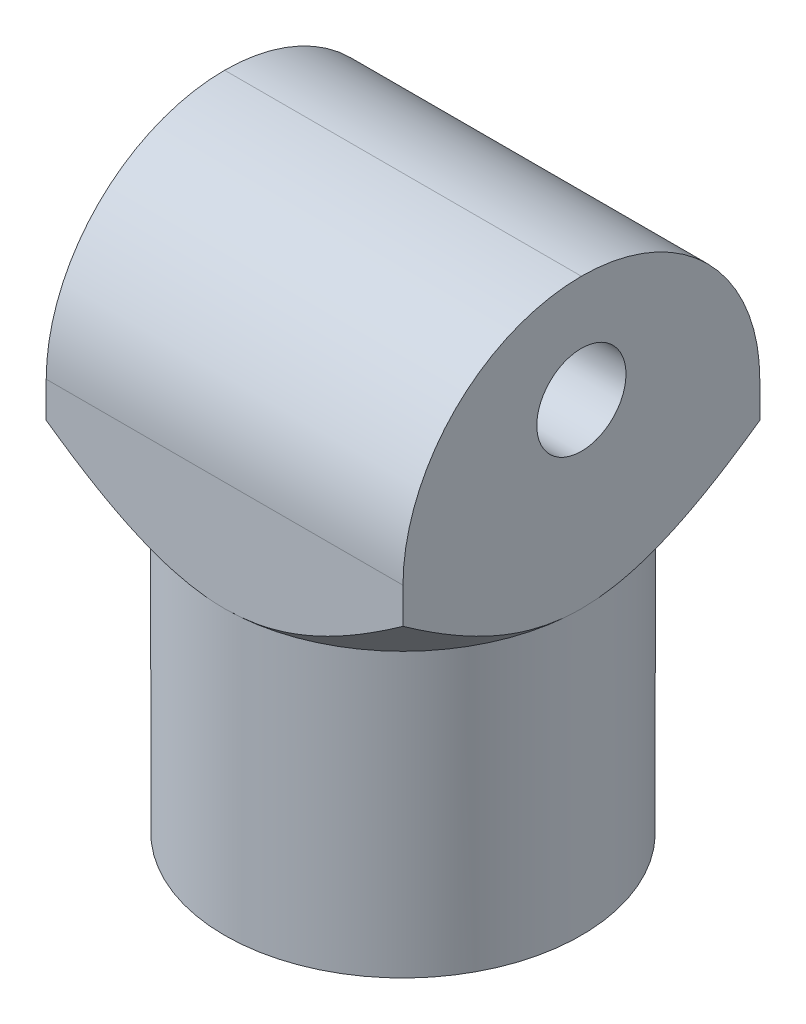
ISO-10303-21;
HEADER;
FILE_DESCRIPTION(('STEP AP214'),'2;1');
FILE_NAME('part.step','',(''),(''),'','','');
FILE_SCHEMA(('AUTOMOTIVE_DESIGN { 1 0 10303 214 1 1 1 1 }'));
ENDSEC;
DATA;
#1=APPLICATION_CONTEXT('core data for automotive mechanical design processes');
#2=APPLICATION_PROTOCOL_DEFINITION('international standard','automotive_design',2000,#1);
#3=PRODUCT_CONTEXT('',#1,'mechanical');
#4=PRODUCT('Part','Part','',(#3));
#5=PRODUCT_RELATED_PRODUCT_CATEGORY('part','',(#4));
#6=PRODUCT_DEFINITION_FORMATION('','',#4);
#7=PRODUCT_DEFINITION_CONTEXT('part definition',#1,'design');
#8=PRODUCT_DEFINITION('design','',#6,#7);
#9=PRODUCT_DEFINITION_SHAPE('','',#8);
#10=(LENGTH_UNIT() NAMED_UNIT(*) SI_UNIT(.MILLI.,.METRE.));
#11=(NAMED_UNIT(*) PLANE_ANGLE_UNIT() SI_UNIT($,.RADIAN.));
#12=(NAMED_UNIT(*) SI_UNIT($,.STERADIAN.) SOLID_ANGLE_UNIT());
#13=UNCERTAINTY_MEASURE_WITH_UNIT(LENGTH_MEASURE(1.E-05),#10,'distance_accuracy_value','');
#14=(GEOMETRIC_REPRESENTATION_CONTEXT(3) GLOBAL_UNCERTAINTY_ASSIGNED_CONTEXT((#13)) GLOBAL_UNIT_ASSIGNED_CONTEXT((#10,
#11,#12)) REPRESENTATION_CONTEXT('',''));
#15=CARTESIAN_POINT('',(0.,0.,0.));
#16=DIRECTION('',(0.,0.,1.));
#17=DIRECTION('',(1.,0.,0.));
#18=AXIS2_PLACEMENT_3D('',#15,#16,#17);
#19=CARTESIAN_POINT('',(0.,0.,0.));
#20=DIRECTION('',(0.,-1.,0.));
#21=DIRECTION('',(0.,0.,-1.));
#22=AXIS2_PLACEMENT_3D('',#19,#20,#21);
#23=PLANE('',#22);
#24=DIRECTION('',(0.,0.,-1.));
#25=VECTOR('',#24,1.);
#26=CARTESIAN_POINT('',(10.,0.,0.));
#27=LINE('',#26,#25);
#28=CARTESIAN_POINT('',(10.,0.,-9.9984897719211));
#29=VERTEX_POINT('',#28);
#30=CARTESIAN_POINT('',(10.,0.,-10.));
#31=VERTEX_POINT('',#30);
#32=EDGE_CURVE('E230',#29,#31,#27,.T.);
#33=ORIENTED_EDGE('',*,*,#32,.F.);
#34=CARTESIAN_POINT('',(5.,0.,-5.));
#35=DIRECTION('',(0.,-1.,0.));
#36=DIRECTION('',(0.,0.,-1.));
#37=AXIS2_PLACEMENT_3D('',#34,#35,#36);
#38=CIRCLE('',#37,7.06999999999999);
#39=CARTESIAN_POINT('',(9.9984897719211,0.,-10.));
#40=VERTEX_POINT('',#39);
#41=EDGE_CURVE('E279',#29,#40,#38,.F.);
#42=ORIENTED_EDGE('',*,*,#41,.T.);
#43=DIRECTION('',(-1.,0.,0.));
#44=VECTOR('',#43,1.);
#45=CARTESIAN_POINT('',(0.,0.,-10.));
#46=LINE('',#45,#44);
#47=EDGE_CURVE('E235',#31,#40,#46,.T.);
#48=ORIENTED_EDGE('',*,*,#47,.F.);
#49=EDGE_LOOP('',(#33,#42,#48));
#50=FACE_BOUND('',#49,.T.);
#51=ADVANCED_FACE('F32',(#50),#23,.T.);
#52=DIRECTION('',(1.,0.,0.));
#53=VECTOR('',#52,1.);
#54=CARTESIAN_POINT('',(0.,0.,0.));
#55=LINE('',#54,#53);
#56=CARTESIAN_POINT('',(9.9984897719211,0.,0.));
#57=VERTEX_POINT('',#56);
#58=CARTESIAN_POINT('',(10.,0.,0.));
#59=VERTEX_POINT('',#58);
#60=EDGE_CURVE('E226',#57,#59,#55,.T.);
#61=ORIENTED_EDGE('',*,*,#60,.F.);
#62=CARTESIAN_POINT('',(5.,0.,-5.));
#63=DIRECTION('',(0.,-1.,0.));
#64=DIRECTION('',(0.,0.,-1.));
#65=AXIS2_PLACEMENT_3D('',#62,#63,#64);
#66=CIRCLE('',#65,7.06999999999999);
#67=CARTESIAN_POINT('',(10.,0.,-0.00151022807889948));
#68=VERTEX_POINT('',#67);
#69=EDGE_CURVE('E274',#57,#68,#66,.F.);
#70=ORIENTED_EDGE('',*,*,#69,.T.);
#71=EDGE_CURVE('E231',#59,#68,#27,.T.);
#72=ORIENTED_EDGE('',*,*,#71,.F.);
#73=EDGE_LOOP('',(#61,#70,#72));
#74=FACE_BOUND('',#73,.T.);
#75=ADVANCED_FACE('F379',(#74),#23,.T.);
#76=DIRECTION('',(0.,0.,1.));
#77=VECTOR('',#76,1.);
#78=CARTESIAN_POINT('',(0.,0.,0.));
#79=LINE('',#78,#77);
#80=CARTESIAN_POINT('',(0.,0.,-0.00151022807889842));
#81=VERTEX_POINT('',#80);
#82=CARTESIAN_POINT('',(0.,0.,0.));
#83=VERTEX_POINT('',#82);
#84=EDGE_CURVE('E220',#81,#83,#79,.T.);
#85=ORIENTED_EDGE('',*,*,#84,.F.);
#86=CARTESIAN_POINT('',(5.,0.,-5.));
#87=DIRECTION('',(0.,-1.,0.));
#88=DIRECTION('',(0.,0.,-1.));
#89=AXIS2_PLACEMENT_3D('',#86,#87,#88);
#90=CIRCLE('',#89,7.06999999999999);
#91=CARTESIAN_POINT('',(0.00151022807889958,0.,0.));
#92=VERTEX_POINT('',#91);
#93=EDGE_CURVE('E277',#81,#92,#90,.F.);
#94=ORIENTED_EDGE('',*,*,#93,.T.);
#95=EDGE_CURVE('E227',#83,#92,#55,.T.);
#96=ORIENTED_EDGE('',*,*,#95,.F.);
#97=EDGE_LOOP('',(#85,#94,#96));
#98=FACE_BOUND('',#97,.T.);
#99=ADVANCED_FACE('F381',(#98),#23,.T.);
#100=CARTESIAN_POINT('',(0.,6.,0.));
#101=DIRECTION('',(1.,0.,0.));
#102=DIRECTION('',(0.,0.,-1.));
#103=AXIS2_PLACEMENT_3D('',#100,#101,#102);
#104=PLANE('',#103);
#105=CARTESIAN_POINT('',(0.,3.,-5.));
#106=DIRECTION('',(1.,0.,0.));
#107=DIRECTION('',(0.,0.,-1.));
#108=AXIS2_PLACEMENT_3D('',#105,#106,#107);
#109=CIRCLE('',#108,1.25);
#110=CARTESIAN_POINT('',(0.,3.,-6.25));
#111=VERTEX_POINT('',#110);
#112=EDGE_CURVE('E217',#111,#111,#109,.T.);
#113=ORIENTED_EDGE('',*,*,#112,.T.);
#114=EDGE_LOOP('',(#113));
#115=FACE_BOUND('',#114,.T.);
#116=CARTESIAN_POINT('',(0.,1.,-5.));
#117=DIRECTION('',(1.,0.,0.));
#118=DIRECTION('',(0.,0.,-1.));
#119=AXIS2_PLACEMENT_3D('',#116,#117,#118);
#120=CIRCLE('',#119,5.);
#121=CARTESIAN_POINT('',(0.,1.,0.));
#122=VERTEX_POINT('',#121);
#123=CARTESIAN_POINT('',(0.,6.,-5.));
#124=VERTEX_POINT('',#123);
#125=EDGE_CURVE('E249',#122,#124,#120,.F.);
#126=ORIENTED_EDGE('',*,*,#125,.T.);
#127=CARTESIAN_POINT('',(0.,1.,-5.));
#128=DIRECTION('',(1.,0.,0.));
#129=DIRECTION('',(0.,0.,-1.));
#130=AXIS2_PLACEMENT_3D('',#127,#128,#129);
#131=CIRCLE('',#130,5.);
#132=CARTESIAN_POINT('',(0.,1.,-10.));
#133=VERTEX_POINT('',#132);
#134=EDGE_CURVE('E251',#124,#133,#131,.F.);
#135=ORIENTED_EDGE('',*,*,#134,.T.);
#136=DIRECTION('',(0.,-1.,0.));
#137=VECTOR('',#136,1.);
#138=CARTESIAN_POINT('',(0.,6.,-10.));
#139=LINE('',#138,#137);
#140=CARTESIAN_POINT('',(0.,0.,-10.));
#141=VERTEX_POINT('',#140);
#142=EDGE_CURVE('E237',#133,#141,#139,.T.);
#143=ORIENTED_EDGE('',*,*,#142,.T.);
#144=CARTESIAN_POINT('',(0.,0.,-9.9984897719211));
#145=VERTEX_POINT('',#144);
#146=EDGE_CURVE('E224',#141,#145,#79,.T.);
#147=ORIENTED_EDGE('',*,*,#146,.T.);
#148=CARTESIAN_POINT('',(0.,0.,-9.9984897719211));
#149=CARTESIAN_POINT('',(0.,-0.102756698613822,-9.85309425427614));
#150=CARTESIAN_POINT('',(0.,-0.204079115607872,-9.70665832138957));
#151=CARTESIAN_POINT('',(0.,-0.40313592951205,-9.4112509153773));
#152=CARTESIAN_POINT('',(0.,-0.500868254858224,-9.26227804874581));
#153=CARTESIAN_POINT('',(0.,-0.693142758224082,-8.95956069469282));
#154=CARTESIAN_POINT('',(0.,-0.787627299717254,-8.80577940843457));
#155=CARTESIAN_POINT('',(0.,-0.970938991346809,-8.49489868974961));
#156=CARTESIAN_POINT('',(0.,-1.05976712341148,-8.33779983957767));
#157=CARTESIAN_POINT('',(0.,-1.22625401262509,-8.02748549687834));
#158=CARTESIAN_POINT('',(0.,-1.30424512519817,-7.87444937340642));
#159=CARTESIAN_POINT('',(0.,-1.45232439178116,-7.56452935080698));
#160=CARTESIAN_POINT('',(0.,-1.52241097336956,-7.40764469363422));
#161=CARTESIAN_POINT('',(0.,-1.65244229095171,-7.09062647658542));
#162=CARTESIAN_POINT('',(0.,-1.71243696695435,-6.93051358702973));
#163=CARTESIAN_POINT('',(0.,-1.82051416016735,-6.60636156662115));
#164=CARTESIAN_POINT('',(0.,-1.86860470886746,-6.44232516527645));
#165=CARTESIAN_POINT('',(0.,-1.93523631882874,-6.17297723086209));
#166=CARTESIAN_POINT('',(0.,-1.95809421411976,-6.06872617683342));
#167=CARTESIAN_POINT('',(0.,-1.9977877490829,-5.85903423202377));
#168=CARTESIAN_POINT('',(0.,-2.01462132107499,-5.75359294551289));
#169=CARTESIAN_POINT('',(0.,-2.04200882366108,-5.54037346704338));
#170=CARTESIAN_POINT('',(0.,-2.05247049983673,-5.43258332218147));
#171=CARTESIAN_POINT('',(0.,-2.06648400154385,-5.21653371459881));
#172=CARTESIAN_POINT('',(0.,-2.07003432623194,-5.10827415505601));
#173=CARTESIAN_POINT('',(0.,-2.07000000000001,-5.));
#174=B_SPLINE_CURVE_WITH_KNOTS('',3,(#148,#149,#150,#151,#152,#153,#154,#155,#156,#157,#158,
#159,#160,#161,#162,#163,#164,#165,#166,#167,#168,#169,#170,#171,#172,#173),.UNSPECIFIED.,.F.,
.F.,(4,2,2,2,2,2,2,2,2,2,2,2,4),(0.,0.534148514532431,1.06860055228239,1.6099675927406,
2.15124039656352,2.66634860230817,3.18155909671436,3.69413985610086,4.20637383852882,
4.5264031591152,4.84654221568575,5.17121252085674,5.49595332236232),.UNSPECIFIED.);
#175=CARTESIAN_POINT('',(0.,-2.07000000000001,-5.));
#176=VERTEX_POINT('',#175);
#177=EDGE_CURVE('E11',#145,#176,#174,.T.);
#178=ORIENTED_EDGE('',*,*,#177,.T.);
#179=CARTESIAN_POINT('',(0.,-2.07000000000001,-5.));
#180=CARTESIAN_POINT('',(0.,-2.07000619883486,-4.92310606943147));
#181=CARTESIAN_POINT('',(0.,-2.06822530632817,-4.84622343214038));
#182=CARTESIAN_POINT('',(0.,-2.0611476450841,-4.69263243662812));
#183=CARTESIAN_POINT('',(0.,-2.05585145443564,-4.6159240518321));
#184=CARTESIAN_POINT('',(0.,-2.03480622205049,-4.38657398673068));
#185=CARTESIAN_POINT('',(0.,-2.013900023987,-4.23438065740981));
#186=CARTESIAN_POINT('',(0.,-1.95991554964958,-3.93496070387796));
#187=CARTESIAN_POINT('',(0.,-1.92705558850698,-3.78769374197493));
#188=CARTESIAN_POINT('',(0.,-1.85058687262751,-3.49597531311927));
#189=CARTESIAN_POINT('',(0.,-1.80697502026895,-3.3515246705131));
#190=CARTESIAN_POINT('',(0.,-1.66293565073777,-2.92441570838595));
#191=CARTESIAN_POINT('',(0.,-1.54896253908638,-2.64629722034861));
#192=CARTESIAN_POINT('',(0.,-1.35908722086213,-2.23792364603919));
#193=CARTESIAN_POINT('',(0.,-1.29253114279358,-2.10307497843222));
#194=CARTESIAN_POINT('',(0.,-1.15415515607734,-1.83610120688809));
#195=CARTESIAN_POINT('',(0.,-1.08233588932663,-1.70397577333601));
#196=CARTESIAN_POINT('',(0.,-0.931471899639767,-1.43712087058268));
#197=CARTESIAN_POINT('',(0.,-0.85225486965176,-1.30248963825339));
#198=CARTESIAN_POINT('',(0.,-0.68992385638343,-1.03558496064705));
#199=CARTESIAN_POINT('',(0.,-0.606809491233823,-0.903311748173727));
#200=CARTESIAN_POINT('',(0.,-0.437911647963068,-0.641729432066824));
#201=CARTESIAN_POINT('',(0.,-0.352149507407178,-0.51240649459764));
#202=CARTESIAN_POINT('',(0.,-0.177957984889134,-0.255628701573782));
#203=CARTESIAN_POINT('',(0.,-0.0895294794680639,-0.128173252140127));
#204=CARTESIAN_POINT('',(0.,0.,-0.0015102280788978));
#205=B_SPLINE_CURVE_WITH_KNOTS('',3,(#179,#180,#181,#182,#183,#184,#185,#186,#187,#188,#189,
#190,#191,#192,#193,#194,#195,#196,#197,#198,#199,#200,#201,#202,#203,#204),.UNSPECIFIED.,.F.,
.F.,(4,2,2,2,2,2,2,2,2,2,2,2,4),(0.,0.230639600941303,0.4612412827156,0.921468133464362,
1.37368020813265,1.82602271773583,2.72553875715213,3.17662343299797,3.62765318594775,
4.09620448922505,4.5648017984917,5.03029381165293,5.49563443238351),.UNSPECIFIED.);
#206=EDGE_CURVE('E314',#176,#81,#205,.T.);
#207=ORIENTED_EDGE('',*,*,#206,.T.);
#208=ORIENTED_EDGE('',*,*,#84,.T.);
#209=DIRECTION('',(0.,-1.,0.));
#210=VECTOR('',#209,1.);
#211=CARTESIAN_POINT('',(0.,6.,0.));
#212=LINE('',#211,#210);
#213=EDGE_CURVE('E246',#122,#83,#212,.T.);
#214=ORIENTED_EDGE('',*,*,#213,.F.);
#215=EDGE_LOOP('',(#126,#135,#143,#147,#178,#207,#208,#214));
#216=FACE_BOUND('',#215,.T.);
#217=ADVANCED_FACE('F386',(#115,#216),#104,.F.);
#218=CARTESIAN_POINT('',(0.,6.,0.));
#219=DIRECTION('',(0.,0.,-1.));
#220=DIRECTION('',(-1.,0.,0.));
#221=AXIS2_PLACEMENT_3D('',#218,#219,#220);
#222=PLANE('',#221);
#223=DIRECTION('',(0.,-1.,0.));
#224=VECTOR('',#223,1.);
#225=CARTESIAN_POINT('',(10.,6.,0.));
#226=LINE('',#225,#224);
#227=CARTESIAN_POINT('',(10.,1.,0.));
#228=VERTEX_POINT('',#227);
#229=EDGE_CURVE('E243',#228,#59,#226,.T.);
#230=ORIENTED_EDGE('',*,*,#229,.F.);
#231=DIRECTION('',(1.,0.,0.));
#232=VECTOR('',#231,1.);
#233=CARTESIAN_POINT('',(0.,1.,0.));
#234=LINE('',#233,#232);
#235=EDGE_CURVE('E260',#228,#122,#234,.F.);
#236=ORIENTED_EDGE('',*,*,#235,.T.);
#237=ORIENTED_EDGE('',*,*,#213,.T.);
#238=ORIENTED_EDGE('',*,*,#95,.T.);
#239=CARTESIAN_POINT('',(0.00151022807889958,0.,0.));
#240=CARTESIAN_POINT('',(0.146905745723856,-0.102756698613823,0.));
#241=CARTESIAN_POINT('',(0.293341678610426,-0.204079115607873,0.));
#242=CARTESIAN_POINT('',(0.588749084622701,-0.403135929512052,0.));
#243=CARTESIAN_POINT('',(0.737721951254193,-0.500868254858225,0.));
#244=CARTESIAN_POINT('',(1.04043930530718,-0.693142758224084,0.));
#245=CARTESIAN_POINT('',(1.19422059156543,-0.787627299717255,0.));
#246=CARTESIAN_POINT('',(1.50510131025039,-0.97093899134681,0.));
#247=CARTESIAN_POINT('',(1.66220016042233,-1.05976712341148,0.));
#248=CARTESIAN_POINT('',(1.97251450312166,-1.22625401262509,0.));
#249=CARTESIAN_POINT('',(2.12555062659358,-1.30424512519817,0.));
#250=CARTESIAN_POINT('',(2.43547064919302,-1.45232439178116,0.));
#251=CARTESIAN_POINT('',(2.59235530636578,-1.52241097336956,0.));
#252=CARTESIAN_POINT('',(2.90937352341458,-1.65244229095171,0.));
#253=CARTESIAN_POINT('',(3.06948641297027,-1.71243696695435,0.));
#254=CARTESIAN_POINT('',(3.39363843337885,-1.82051416016735,0.));
#255=CARTESIAN_POINT('',(3.55767483472355,-1.86860470886746,0.));
#256=CARTESIAN_POINT('',(3.82702276913791,-1.93523631882874,0.));
#257=CARTESIAN_POINT('',(3.93127382316658,-1.95809421411976,0.));
#258=CARTESIAN_POINT('',(4.14096576797622,-1.99778774908291,0.));
#259=CARTESIAN_POINT('',(4.24640705448711,-2.01462132107499,0.));
#260=CARTESIAN_POINT('',(4.45962653295662,-2.04200882366108,0.));
#261=CARTESIAN_POINT('',(4.56741667781853,-2.05247049983673,0.));
#262=CARTESIAN_POINT('',(4.78346628540119,-2.06648400154386,0.));
#263=CARTESIAN_POINT('',(4.89172584494398,-2.07003432623195,0.));
#264=CARTESIAN_POINT('',(5.,-2.07000000000001,0.));
#265=B_SPLINE_CURVE_WITH_KNOTS('',3,(#239,#240,#241,#242,#243,#244,#245,#246,#247,#248,#249,
#250,#251,#252,#253,#254,#255,#256,#257,#258,#259,#260,#261,#262,#263,#264),.UNSPECIFIED.,.F.,
.F.,(4,2,2,2,2,2,2,2,2,2,2,2,4),(0.,0.534148514532431,1.06860055228239,1.6099675927406,
2.15124039656352,2.66634860230818,3.18155909671436,3.69413985610086,4.20637383852882,
4.5264031591152,4.84654221568575,5.17121252085674,5.49595332236232),.UNSPECIFIED.);
#266=CARTESIAN_POINT('',(5.,-2.07000000000001,0.));
#267=VERTEX_POINT('',#266);
#268=EDGE_CURVE('E319',#92,#267,#265,.T.);
#269=ORIENTED_EDGE('',*,*,#268,.T.);
#270=CARTESIAN_POINT('',(5.,-2.07000000000001,0.));
#271=CARTESIAN_POINT('',(5.07689393056853,-2.07000619883486,0.));
#272=CARTESIAN_POINT('',(5.15377656785962,-2.06822530632817,0.));
#273=CARTESIAN_POINT('',(5.30736756337188,-2.0611476450841,0.));
#274=CARTESIAN_POINT('',(5.38407594816791,-2.05585145443564,0.));
#275=CARTESIAN_POINT('',(5.61342601326932,-2.03480622205049,0.));
#276=CARTESIAN_POINT('',(5.76561934259019,-2.013900023987,0.));
#277=CARTESIAN_POINT('',(6.06503929612204,-1.95991554964958,0.));
#278=CARTESIAN_POINT('',(6.21230625802507,-1.92705558850698,0.));
#279=CARTESIAN_POINT('',(6.50402468688073,-1.85058687262751,0.));
#280=CARTESIAN_POINT('',(6.6484753294869,-1.80697502026895,0.));
#281=CARTESIAN_POINT('',(7.07558429161405,-1.66293565073777,0.));
#282=CARTESIAN_POINT('',(7.35370277965139,-1.54896253908638,0.));
#283=CARTESIAN_POINT('',(7.76207635396081,-1.35908722086213,0.));
#284=CARTESIAN_POINT('',(7.89692502156778,-1.29253114279358,0.));
#285=CARTESIAN_POINT('',(8.16389879311191,-1.15415515607734,0.));
#286=CARTESIAN_POINT('',(8.29602422666399,-1.08233588932663,0.));
#287=CARTESIAN_POINT('',(8.56287912941732,-0.931471899639769,0.));
#288=CARTESIAN_POINT('',(8.69751036174661,-0.852254869651762,0.));
#289=CARTESIAN_POINT('',(8.96441503935295,-0.689923856383432,0.));
#290=CARTESIAN_POINT('',(9.09668825182627,-0.606809491233825,0.));
#291=CARTESIAN_POINT('',(9.35827056793318,-0.43791164796307,0.));
#292=CARTESIAN_POINT('',(9.48759350540236,-0.352149507407181,0.));
#293=CARTESIAN_POINT('',(9.74437129842622,-0.177957984889136,0.));
#294=CARTESIAN_POINT('',(9.87182674785987,-0.0895294794680655,0.));
#295=CARTESIAN_POINT('',(9.9984897719211,0.,0.));
#296=B_SPLINE_CURVE_WITH_KNOTS('',3,(#270,#271,#272,#273,#274,#275,#276,#277,#278,#279,#280,
#281,#282,#283,#284,#285,#286,#287,#288,#289,#290,#291,#292,#293,#294,#295),.UNSPECIFIED.,.F.,
.F.,(4,2,2,2,2,2,2,2,2,2,2,2,4),(0.,0.230639600941303,0.4612412827156,0.921468133464363,
1.37368020813266,1.82602271773583,2.72553875715213,3.17662343299797,3.62765318594775,
4.09620448922504,4.5648017984917,5.03029381165292,5.49563443238351),.UNSPECIFIED.);
#297=EDGE_CURVE('E283',#267,#57,#296,.T.);
#298=ORIENTED_EDGE('',*,*,#297,.T.);
#299=ORIENTED_EDGE('',*,*,#60,.T.);
#300=EDGE_LOOP('',(#230,#236,#237,#238,#269,#298,#299));
#301=FACE_BOUND('',#300,.T.);
#302=ADVANCED_FACE('F296',(#301),#222,.F.);
#303=CARTESIAN_POINT('',(10.,6.,0.));
#304=DIRECTION('',(-1.,0.,0.));
#305=DIRECTION('',(0.,0.,1.));
#306=AXIS2_PLACEMENT_3D('',#303,#304,#305);
#307=PLANE('',#306);
#308=CARTESIAN_POINT('',(10.,3.,-5.));
#309=DIRECTION('',(1.,0.,0.));
#310=DIRECTION('',(0.,0.,-1.));
#311=AXIS2_PLACEMENT_3D('',#308,#309,#310);
#312=CIRCLE('',#311,1.25);
#313=CARTESIAN_POINT('',(10.,3.,-6.25));
#314=VERTEX_POINT('',#313);
#315=EDGE_CURVE('E221',#314,#314,#312,.T.);
#316=ORIENTED_EDGE('',*,*,#315,.F.);
#317=EDGE_LOOP('',(#316));
#318=FACE_BOUND('',#317,.T.);
#319=DIRECTION('',(0.,-1.,0.));
#320=VECTOR('',#319,1.);
#321=CARTESIAN_POINT('',(10.,6.,-10.));
#322=LINE('',#321,#320);
#323=CARTESIAN_POINT('',(10.,1.,-10.));
#324=VERTEX_POINT('',#323);
#325=EDGE_CURVE('E240',#324,#31,#322,.T.);
#326=ORIENTED_EDGE('',*,*,#325,.F.);
#327=CARTESIAN_POINT('',(10.,1.,-5.));
#328=DIRECTION('',(-1.,0.,0.));
#329=DIRECTION('',(0.,0.,1.));
#330=AXIS2_PLACEMENT_3D('',#327,#328,#329);
#331=CIRCLE('',#330,5.);
#332=CARTESIAN_POINT('',(10.,6.,-5.));
#333=VERTEX_POINT('',#332);
#334=EDGE_CURVE('E258',#324,#333,#331,.F.);
#335=ORIENTED_EDGE('',*,*,#334,.T.);
#336=CARTESIAN_POINT('',(10.,1.,-5.));
#337=DIRECTION('',(-1.,0.,0.));
#338=DIRECTION('',(0.,0.,1.));
#339=AXIS2_PLACEMENT_3D('',#336,#337,#338);
#340=CIRCLE('',#339,5.);
#341=EDGE_CURVE('E256',#333,#228,#340,.F.);
#342=ORIENTED_EDGE('',*,*,#341,.T.);
#343=ORIENTED_EDGE('',*,*,#229,.T.);
#344=ORIENTED_EDGE('',*,*,#71,.T.);
#345=CARTESIAN_POINT('',(10.,0.,-0.00151022807889948));
#346=CARTESIAN_POINT('',(10.,-0.102756698613823,-0.146905745723856));
#347=CARTESIAN_POINT('',(10.,-0.204079115607873,-0.293341678610426));
#348=CARTESIAN_POINT('',(10.,-0.403135929512051,-0.588749084622702));
#349=CARTESIAN_POINT('',(10.,-0.500868254858224,-0.737721951254194));
#350=CARTESIAN_POINT('',(10.,-0.693142758224083,-1.04043930530718));
#351=CARTESIAN_POINT('',(10.,-0.787627299717256,-1.19422059156543));
#352=CARTESIAN_POINT('',(10.,-0.97093899134681,-1.50510131025039));
#353=CARTESIAN_POINT('',(10.,-1.05976712341148,-1.66220016042233));
#354=CARTESIAN_POINT('',(10.,-1.22625401262509,-1.97251450312166));
#355=CARTESIAN_POINT('',(10.,-1.30424512519817,-2.12555062659358));
#356=CARTESIAN_POINT('',(10.,-1.45232439178116,-2.43547064919302));
#357=CARTESIAN_POINT('',(10.,-1.52241097336956,-2.59235530636578));
#358=CARTESIAN_POINT('',(10.,-1.65244229095171,-2.90937352341458));
#359=CARTESIAN_POINT('',(10.,-1.71243696695435,-3.06948641297027));
#360=CARTESIAN_POINT('',(10.,-1.82051416016735,-3.39363843337885));
#361=CARTESIAN_POINT('',(10.,-1.86860470886746,-3.55767483472355));
#362=CARTESIAN_POINT('',(10.,-1.93523631882874,-3.82702276913791));
#363=CARTESIAN_POINT('',(10.,-1.95809421411976,-3.93127382316658));
#364=CARTESIAN_POINT('',(10.,-1.9977877490829,-4.14096576797622));
#365=CARTESIAN_POINT('',(10.,-2.01462132107499,-4.24640705448711));
#366=CARTESIAN_POINT('',(10.,-2.04200882366108,-4.45962653295662));
#367=CARTESIAN_POINT('',(10.,-2.05247049983673,-4.56741667781853));
#368=CARTESIAN_POINT('',(10.,-2.06648400154385,-4.78346628540119));
#369=CARTESIAN_POINT('',(10.,-2.07003432623194,-4.89172584494398));
#370=CARTESIAN_POINT('',(10.,-2.07000000000001,-5.));
#371=B_SPLINE_CURVE_WITH_KNOTS('',3,(#345,#346,#347,#348,#349,#350,#351,#352,#353,#354,#355,
#356,#357,#358,#359,#360,#361,#362,#363,#364,#365,#366,#367,#368,#369,#370),.UNSPECIFIED.,.F.,
.F.,(4,2,2,2,2,2,2,2,2,2,2,2,4),(0.,0.534148514532432,1.06860055228239,1.6099675927406,
2.15124039656352,2.66634860230818,3.18155909671436,3.69413985610086,4.20637383852882,
4.5264031591152,4.84654221568575,5.17121252085674,5.49595332236232),.UNSPECIFIED.);
#372=CARTESIAN_POINT('',(10.,-2.07000000000001,-5.));
#373=VERTEX_POINT('',#372);
#374=EDGE_CURVE('E290',#68,#373,#371,.T.);
#375=ORIENTED_EDGE('',*,*,#374,.T.);
#376=CARTESIAN_POINT('',(10.,-2.07000000000001,-5.));
#377=CARTESIAN_POINT('',(10.,-2.07000619883486,-5.07689393056853));
#378=CARTESIAN_POINT('',(10.,-2.06822530632817,-5.15377656785962));
#379=CARTESIAN_POINT('',(10.,-2.0611476450841,-5.30736756337188));
#380=CARTESIAN_POINT('',(10.,-2.05585145443564,-5.38407594816791));
#381=CARTESIAN_POINT('',(10.,-2.03480622205049,-5.61342601326932));
#382=CARTESIAN_POINT('',(10.,-2.013900023987,-5.76561934259019));
#383=CARTESIAN_POINT('',(10.,-1.95991554964958,-6.06503929612204));
#384=CARTESIAN_POINT('',(10.,-1.92705558850698,-6.21230625802507));
#385=CARTESIAN_POINT('',(10.,-1.85058687262751,-6.50402468688073));
#386=CARTESIAN_POINT('',(10.,-1.80697502026895,-6.6484753294869));
#387=CARTESIAN_POINT('',(10.,-1.66293565073777,-7.07558429161405));
#388=CARTESIAN_POINT('',(10.,-1.54896253908638,-7.35370277965139));
#389=CARTESIAN_POINT('',(10.,-1.35908722086212,-7.76207635396081));
#390=CARTESIAN_POINT('',(10.,-1.29253114279358,-7.89692502156778));
#391=CARTESIAN_POINT('',(10.,-1.15415515607734,-8.16389879311191));
#392=CARTESIAN_POINT('',(10.,-1.08233588932663,-8.29602422666399));
#393=CARTESIAN_POINT('',(10.,-0.931471899639768,-8.56287912941732));
#394=CARTESIAN_POINT('',(10.,-0.852254869651761,-8.69751036174661));
#395=CARTESIAN_POINT('',(10.,-0.689923856383431,-8.96441503935294));
#396=CARTESIAN_POINT('',(10.,-0.606809491233825,-9.09668825182627));
#397=CARTESIAN_POINT('',(10.,-0.43791164796307,-9.35827056793318));
#398=CARTESIAN_POINT('',(10.,-0.35214950740718,-9.48759350540236));
#399=CARTESIAN_POINT('',(10.,-0.177957984889135,-9.74437129842621));
#400=CARTESIAN_POINT('',(10.,-0.089529479468064,-9.87182674785987));
#401=CARTESIAN_POINT('',(10.,0.,-9.9984897719211));
#402=B_SPLINE_CURVE_WITH_KNOTS('',3,(#376,#377,#378,#379,#380,#381,#382,#383,#384,#385,#386,
#387,#388,#389,#390,#391,#392,#393,#394,#395,#396,#397,#398,#399,#400,#401),.UNSPECIFIED.,.F.,
.F.,(4,2,2,2,2,2,2,2,2,2,2,2,4),(0.,0.230639600941304,0.461241282715601,0.921468133464364,
1.37368020813266,1.82602271773583,2.72553875715213,3.17662343299797,3.62765318594775,
4.09620448922504,4.5648017984917,5.03029381165292,5.49563443238351),.UNSPECIFIED.);
#403=EDGE_CURVE('E324',#373,#29,#402,.T.);
#404=ORIENTED_EDGE('',*,*,#403,.T.);
#405=ORIENTED_EDGE('',*,*,#32,.T.);
#406=EDGE_LOOP('',(#326,#335,#342,#343,#344,#375,#404,#405));
#407=FACE_BOUND('',#406,.T.);
#408=ADVANCED_FACE('F333',(#318,#407),#307,.F.);
#409=CARTESIAN_POINT('',(0.,6.,-10.));
#410=DIRECTION('',(0.,0.,1.));
#411=DIRECTION('',(1.,0.,0.));
#412=AXIS2_PLACEMENT_3D('',#409,#410,#411);
#413=PLANE('',#412);
#414=ORIENTED_EDGE('',*,*,#142,.F.);
#415=DIRECTION('',(-1.,0.,0.));
#416=VECTOR('',#415,1.);
#417=CARTESIAN_POINT('',(0.,1.,-10.));
#418=LINE('',#417,#416);
#419=EDGE_CURVE('E253',#133,#324,#418,.F.);
#420=ORIENTED_EDGE('',*,*,#419,.T.);
#421=ORIENTED_EDGE('',*,*,#325,.T.);
#422=ORIENTED_EDGE('',*,*,#47,.T.);
#423=CARTESIAN_POINT('',(9.9984897719211,0.,-10.));
#424=CARTESIAN_POINT('',(9.85309425427614,-0.102756698613823,-10.));
#425=CARTESIAN_POINT('',(9.70665832138957,-0.204079115607872,-10.));
#426=CARTESIAN_POINT('',(9.4112509153773,-0.40313592951205,-10.));
#427=CARTESIAN_POINT('',(9.2622780487458,-0.500868254858224,-10.));
#428=CARTESIAN_POINT('',(8.95956069469282,-0.693142758224083,-10.));
#429=CARTESIAN_POINT('',(8.80577940843457,-0.787627299717255,-10.));
#430=CARTESIAN_POINT('',(8.49489868974961,-0.97093899134681,-10.));
#431=CARTESIAN_POINT('',(8.33779983957767,-1.05976712341148,-10.));
#432=CARTESIAN_POINT('',(8.02748549687834,-1.22625401262509,-10.));
#433=CARTESIAN_POINT('',(7.87444937340642,-1.30424512519817,-10.));
#434=CARTESIAN_POINT('',(7.56452935080698,-1.45232439178116,-10.));
#435=CARTESIAN_POINT('',(7.40764469363422,-1.52241097336956,-10.));
#436=CARTESIAN_POINT('',(7.09062647658542,-1.65244229095171,-10.));
#437=CARTESIAN_POINT('',(6.93051358702973,-1.71243696695435,-10.));
#438=CARTESIAN_POINT('',(6.60636156662115,-1.82051416016735,-10.));
#439=CARTESIAN_POINT('',(6.44232516527644,-1.86860470886745,-10.));
#440=CARTESIAN_POINT('',(6.17297723086209,-1.93523631882874,-10.));
#441=CARTESIAN_POINT('',(6.06872617683342,-1.95809421411976,-10.));
#442=CARTESIAN_POINT('',(5.85903423202377,-1.9977877490829,-10.));
#443=CARTESIAN_POINT('',(5.75359294551289,-2.01462132107499,-10.));
#444=CARTESIAN_POINT('',(5.54037346704338,-2.04200882366108,-10.));
#445=CARTESIAN_POINT('',(5.43258332218147,-2.05247049983673,-10.));
#446=CARTESIAN_POINT('',(5.21653371459881,-2.06648400154385,-10.));
#447=CARTESIAN_POINT('',(5.10827415505602,-2.07003432623194,-10.));
#448=CARTESIAN_POINT('',(5.,-2.07000000000001,-10.));
#449=B_SPLINE_CURVE_WITH_KNOTS('',3,(#423,#424,#425,#426,#427,#428,#429,#430,#431,#432,#433,
#434,#435,#436,#437,#438,#439,#440,#441,#442,#443,#444,#445,#446,#447,#448),.UNSPECIFIED.,.F.,
.F.,(4,2,2,2,2,2,2,2,2,2,2,2,4),(0.,0.534148514532431,1.06860055228239,1.6099675927406,
2.15124039656352,2.66634860230818,3.18155909671436,3.69413985610086,4.20637383852882,
4.5264031591152,4.84654221568575,5.17121252085674,5.49595332236232),.UNSPECIFIED.);
#450=CARTESIAN_POINT('',(5.,-2.07000000000001,-10.));
#451=VERTEX_POINT('',#450);
#452=EDGE_CURVE('E52',#40,#451,#449,.T.);
#453=ORIENTED_EDGE('',*,*,#452,.T.);
#454=CARTESIAN_POINT('',(5.,-2.07000000000001,-10.));
#455=CARTESIAN_POINT('',(4.92310606943147,-2.07000619883486,-10.));
#456=CARTESIAN_POINT('',(4.84622343214038,-2.06822530632817,-10.));
#457=CARTESIAN_POINT('',(4.69263243662812,-2.0611476450841,-10.));
#458=CARTESIAN_POINT('',(4.6159240518321,-2.05585145443564,-10.));
#459=CARTESIAN_POINT('',(4.38657398673068,-2.03480622205049,-10.));
#460=CARTESIAN_POINT('',(4.23438065740981,-2.013900023987,-10.));
#461=CARTESIAN_POINT('',(3.93496070387796,-1.95991554964958,-10.));
#462=CARTESIAN_POINT('',(3.78769374197493,-1.92705558850698,-10.));
#463=CARTESIAN_POINT('',(3.49597531311927,-1.85058687262751,-10.));
#464=CARTESIAN_POINT('',(3.3515246705131,-1.80697502026895,-10.));
#465=CARTESIAN_POINT('',(2.92441570838595,-1.66293565073777,-10.));
#466=CARTESIAN_POINT('',(2.64629722034861,-1.54896253908638,-10.));
#467=CARTESIAN_POINT('',(2.23792364603919,-1.35908722086212,-10.));
#468=CARTESIAN_POINT('',(2.10307497843222,-1.29253114279358,-10.));
#469=CARTESIAN_POINT('',(1.83610120688809,-1.15415515607734,-10.));
#470=CARTESIAN_POINT('',(1.70397577333601,-1.08233588932663,-10.));
#471=CARTESIAN_POINT('',(1.43712087058268,-0.931471899639767,-10.));
#472=CARTESIAN_POINT('',(1.30248963825339,-0.85225486965176,-10.));
#473=CARTESIAN_POINT('',(1.03558496064705,-0.689923856383431,-10.));
#474=CARTESIAN_POINT('',(0.90331174817373,-0.606809491233824,-10.));
#475=CARTESIAN_POINT('',(0.641729432066827,-0.437911647963069,-10.));
#476=CARTESIAN_POINT('',(0.512406494597643,-0.352149507407179,-10.));
#477=CARTESIAN_POINT('',(0.255628701573785,-0.177957984889135,-10.));
#478=CARTESIAN_POINT('',(0.128173252140131,-0.0895294794680649,-10.));
#479=CARTESIAN_POINT('',(0.0015102280789013,0.,-10.));
#480=B_SPLINE_CURVE_WITH_KNOTS('',3,(#454,#455,#456,#457,#458,#459,#460,#461,#462,#463,#464,
#465,#466,#467,#468,#469,#470,#471,#472,#473,#474,#475,#476,#477,#478,#479),.UNSPECIFIED.,.F.,
.F.,(4,2,2,2,2,2,2,2,2,2,2,2,4),(0.,0.230639600941302,0.4612412827156,0.921468133464363,
1.37368020813266,1.82602271773583,2.72553875715213,3.17662343299797,3.62765318594775,
4.09620448922504,4.5648017984917,5.03029381165292,5.49563443238351),.UNSPECIFIED.);
#481=CARTESIAN_POINT('',(0.00151022807890109,0.,-10.));
#482=VERTEX_POINT('',#481);
#483=EDGE_CURVE('E45',#451,#482,#480,.T.);
#484=ORIENTED_EDGE('',*,*,#483,.T.);
#485=EDGE_CURVE('E234',#482,#141,#46,.T.);
#486=ORIENTED_EDGE('',*,*,#485,.T.);
#487=EDGE_LOOP('',(#414,#420,#421,#422,#453,#484,#486));
#488=FACE_BOUND('',#487,.T.);
#489=ADVANCED_FACE('F336',(#488),#413,.F.);
#490=ORIENTED_EDGE('',*,*,#485,.F.);
#491=CARTESIAN_POINT('',(5.,0.,-5.));
#492=DIRECTION('',(0.,-1.,0.));
#493=DIRECTION('',(0.,0.,-1.));
#494=AXIS2_PLACEMENT_3D('',#491,#492,#493);
#495=CIRCLE('',#494,7.06999999999999);
#496=EDGE_CURVE('E281',#482,#145,#495,.F.);
#497=ORIENTED_EDGE('',*,*,#496,.T.);
#498=ORIENTED_EDGE('',*,*,#146,.F.);
#499=EDGE_LOOP('',(#490,#497,#498));
#500=FACE_BOUND('',#499,.T.);
#501=ADVANCED_FACE('F342',(#500),#23,.T.);
#502=CARTESIAN_POINT('',(0.,3.,-5.));
#503=DIRECTION('',(1.,0.,0.));
#504=DIRECTION('',(0.,0.,-1.));
#505=AXIS2_PLACEMENT_3D('',#502,#503,#504);
#506=CYLINDRICAL_SURFACE('',#505,1.25);
#507=ORIENTED_EDGE('',*,*,#112,.F.);
#508=EDGE_LOOP('',(#507));
#509=FACE_BOUND('',#508,.T.);
#510=ORIENTED_EDGE('',*,*,#315,.T.);
#511=EDGE_LOOP('',(#510));
#512=FACE_BOUND('',#511,.T.);
#513=ADVANCED_FACE('F393',(#509,#512),#506,.F.);
#514=CARTESIAN_POINT('',(0.,1.,-5.));
#515=DIRECTION('',(1.,0.,0.));
#516=DIRECTION('',(0.,0.,-1.));
#517=AXIS2_PLACEMENT_3D('',#514,#515,#516);
#518=CYLINDRICAL_SURFACE('',#517,5.);
#519=ORIENTED_EDGE('',*,*,#235,.F.);
#520=ORIENTED_EDGE('',*,*,#341,.F.);
#521=DIRECTION('',(1.,0.,0.));
#522=VECTOR('',#521,1.);
#523=CARTESIAN_POINT('',(0.,6.,-5.));
#524=LINE('',#523,#522);
#525=EDGE_CURVE('E216',#124,#333,#524,.T.);
#526=ORIENTED_EDGE('',*,*,#525,.F.);
#527=ORIENTED_EDGE('',*,*,#125,.F.);
#528=EDGE_LOOP('',(#519,#520,#526,#527));
#529=FACE_BOUND('',#528,.T.);
#530=ADVANCED_FACE('F305',(#529),#518,.T.);
#531=CARTESIAN_POINT('',(0.,1.,-5.));
#532=DIRECTION('',(-1.,0.,0.));
#533=DIRECTION('',(0.,0.,1.));
#534=AXIS2_PLACEMENT_3D('',#531,#532,#533);
#535=CYLINDRICAL_SURFACE('',#534,5.);
#536=ORIENTED_EDGE('',*,*,#334,.F.);
#537=ORIENTED_EDGE('',*,*,#419,.F.);
#538=ORIENTED_EDGE('',*,*,#134,.F.);
#539=ORIENTED_EDGE('',*,*,#525,.T.);
#540=EDGE_LOOP('',(#536,#537,#538,#539));
#541=FACE_BOUND('',#540,.T.);
#542=ADVANCED_FACE('F434',(#541),#535,.T.);
#543=CARTESIAN_POINT('',(5.,-10.,-5.));
#544=DIRECTION('',(0.,-1.,0.));
#545=DIRECTION('',(0.,0.,-1.));
#546=AXIS2_PLACEMENT_3D('',#543,#544,#545);
#547=PLANE('',#546);
#548=CARTESIAN_POINT('',(5.,-10.,-5.));
#549=DIRECTION('',(0.,-1.,0.));
#550=DIRECTION('',(0.,0.,-1.));
#551=AXIS2_PLACEMENT_3D('',#548,#549,#550);
#552=CIRCLE('',#551,5.);
#553=CARTESIAN_POINT('',(5.,-10.,-10.));
#554=VERTEX_POINT('',#553);
#555=EDGE_CURVE('E175',#554,#554,#552,.T.);
#556=ORIENTED_EDGE('',*,*,#555,.T.);
#557=EDGE_LOOP('',(#556));
#558=FACE_BOUND('',#557,.T.);
#559=DIRECTION('',(0.992815009250093,0.,0.119659338990895));
#560=VECTOR('',#559,1.);
#561=CARTESIAN_POINT('',(3.63937197843456,-10.,-8.18570108248261));
#562=LINE('',#561,#560);
#563=CARTESIAN_POINT('',(3.63937197843456,-10.,-8.18570108248261));
#564=VERTEX_POINT('',#563);
#565=CARTESIAN_POINT('',(7.07858405551081,-10.,-7.77118897301794));
#566=VERTEX_POINT('',#565);
#567=EDGE_CURVE('E167',#564,#566,#562,.T.);
#568=ORIENTED_EDGE('',*,*,#567,.F.);
#569=DIRECTION('',(0.600035531991215,0.,-0.799973349773616));
#570=VECTOR('',#569,1.);
#571=CARTESIAN_POINT('',(1.56078792292375,-10.,-5.41451210946467));
#572=LINE('',#571,#570);
#573=CARTESIAN_POINT('',(1.56078792292375,-10.,-5.41451210946467));
#574=VERTEX_POINT('',#573);
#575=EDGE_CURVE('E157',#574,#564,#572,.T.);
#576=ORIENTED_EDGE('',*,*,#575,.F.);
#577=DIRECTION('',(-0.392779477258878,0.,-0.91963268876451));
#578=VECTOR('',#577,1.);
#579=CARTESIAN_POINT('',(2.92141594448919,-10.,-2.22881102698206));
#580=LINE('',#579,#578);
#581=CARTESIAN_POINT('',(2.92141594448919,-10.,-2.22881102698206));
#582=VERTEX_POINT('',#581);
#583=EDGE_CURVE('E190',#582,#574,#580,.T.);
#584=ORIENTED_EDGE('',*,*,#583,.F.);
#585=DIRECTION('',(-0.992815009250093,0.,-0.119659338990894));
#586=VECTOR('',#585,1.);
#587=CARTESIAN_POINT('',(6.36062802156544,-10.,-1.81429891751738));
#588=LINE('',#587,#586);
#589=CARTESIAN_POINT('',(6.36062802156544,-10.,-1.81429891751738));
#590=VERTEX_POINT('',#589);
#591=EDGE_CURVE('E187',#590,#582,#588,.T.);
#592=ORIENTED_EDGE('',*,*,#591,.F.);
#593=DIRECTION('',(-0.600035531991215,0.,0.799973349773616));
#594=VECTOR('',#593,1.);
#595=CARTESIAN_POINT('',(8.43921207707625,-10.,-4.58548789053533));
#596=LINE('',#595,#594);
#597=CARTESIAN_POINT('',(8.43921207707625,-10.,-4.58548789053533));
#598=VERTEX_POINT('',#597);
#599=EDGE_CURVE('E183',#598,#590,#596,.T.);
#600=ORIENTED_EDGE('',*,*,#599,.F.);
#601=DIRECTION('',(0.392779477258878,0.,0.91963268876451));
#602=VECTOR('',#601,1.);
#603=CARTESIAN_POINT('',(7.07858405551081,-10.,-7.77118897301794));
#604=LINE('',#603,#602);
#605=EDGE_CURVE('E181',#566,#598,#604,.T.);
#606=ORIENTED_EDGE('',*,*,#605,.F.);
#607=EDGE_LOOP('',(#568,#576,#584,#592,#600,#606));
#608=FACE_BOUND('',#607,.T.);
#609=ADVANCED_FACE('F179',(#558,#608),#547,.T.);
#610=CARTESIAN_POINT('',(5.,-10.,-5.));
#611=DIRECTION('',(0.,1.,0.));
#612=DIRECTION('',(0.,0.,1.));
#613=AXIS2_PLACEMENT_3D('',#610,#611,#612);
#614=CYLINDRICAL_SURFACE('',#613,5.);
#615=CARTESIAN_POINT('',(5.,-2.07000000000001,-5.));
#616=DIRECTION('',(0.,-1.,0.));
#617=DIRECTION('',(0.,0.,-1.));
#618=AXIS2_PLACEMENT_3D('',#615,#616,#617);
#619=CIRCLE('',#618,5.);
#620=EDGE_CURVE('E266',#451,#373,#619,.T.);
#621=ORIENTED_EDGE('',*,*,#620,.T.);
#622=CARTESIAN_POINT('',(5.,-2.07000000000001,-5.));
#623=DIRECTION('',(0.,-1.,0.));
#624=DIRECTION('',(0.,0.,-1.));
#625=AXIS2_PLACEMENT_3D('',#622,#623,#624);
#626=CIRCLE('',#625,5.);
#627=EDGE_CURVE('E271',#373,#267,#626,.T.);
#628=ORIENTED_EDGE('',*,*,#627,.T.);
#629=CARTESIAN_POINT('',(5.,-2.07000000000001,-5.));
#630=DIRECTION('',(0.,-1.,0.));
#631=DIRECTION('',(0.,0.,-1.));
#632=AXIS2_PLACEMENT_3D('',#629,#630,#631);
#633=CIRCLE('',#632,5.);
#634=EDGE_CURVE('E269',#267,#176,#633,.T.);
#635=ORIENTED_EDGE('',*,*,#634,.T.);
#636=CARTESIAN_POINT('',(5.,-2.07000000000001,-5.));
#637=DIRECTION('',(0.,-1.,0.));
#638=DIRECTION('',(0.,0.,-1.));
#639=AXIS2_PLACEMENT_3D('',#636,#637,#638);
#640=CIRCLE('',#639,5.);
#641=EDGE_CURVE('E262',#176,#451,#640,.T.);
#642=ORIENTED_EDGE('',*,*,#641,.T.);
#643=EDGE_LOOP('',(#621,#628,#635,#642));
#644=FACE_BOUND('',#643,.T.);
#645=ORIENTED_EDGE('',*,*,#555,.F.);
#646=EDGE_LOOP('',(#645));
#647=FACE_BOUND('',#646,.T.);
#648=ADVANCED_FACE('F370',(#644,#647),#614,.T.);
#649=CARTESIAN_POINT('',(1.56078792292375,-10.,-5.41451210946467));
#650=DIRECTION('',(0.799973349773616,0.,0.600035531991215));
#651=DIRECTION('',(0.600035531991215,0.,-0.799973349773616));
#652=AXIS2_PLACEMENT_3D('',#649,#650,#651);
#653=PLANE('',#652);
#654=DIRECTION('',(0.600035531991215,0.,-0.799973349773616));
#655=VECTOR('',#654,1.);
#656=CARTESIAN_POINT('',(1.56078792292375,0.,-5.41451210946467));
#657=LINE('',#656,#655);
#658=CARTESIAN_POINT('',(1.56078792292375,0.,-5.41451210946467));
#659=VERTEX_POINT('',#658);
#660=CARTESIAN_POINT('',(3.63937197843456,0.,-8.18570108248261));
#661=VERTEX_POINT('',#660);
#662=EDGE_CURVE('E192',#659,#661,#657,.T.);
#663=ORIENTED_EDGE('',*,*,#662,.F.);
#664=DIRECTION('',(0.,1.,0.));
#665=VECTOR('',#664,1.);
#666=CARTESIAN_POINT('',(1.56078792292375,-10.,-5.41451210946467));
#667=LINE('',#666,#665);
#668=EDGE_CURVE('E163',#574,#659,#667,.T.);
#669=ORIENTED_EDGE('',*,*,#668,.F.);
#670=ORIENTED_EDGE('',*,*,#575,.T.);
#671=DIRECTION('',(0.,1.,0.));
#672=VECTOR('',#671,1.);
#673=CARTESIAN_POINT('',(3.63937197843456,-10.,-8.18570108248261));
#674=LINE('',#673,#672);
#675=EDGE_CURVE('E161',#564,#661,#674,.T.);
#676=ORIENTED_EDGE('',*,*,#675,.T.);
#677=EDGE_LOOP('',(#663,#669,#670,#676));
#678=FACE_BOUND('',#677,.T.);
#679=ADVANCED_FACE('F160',(#678),#653,.T.);
#680=CARTESIAN_POINT('',(3.63937197843456,-10.,-8.18570108248261));
#681=DIRECTION('',(-0.119659338990895,0.,0.992815009250093));
#682=DIRECTION('',(0.992815009250093,0.,0.119659338990895));
#683=AXIS2_PLACEMENT_3D('',#680,#681,#682);
#684=PLANE('',#683);
#685=DIRECTION('',(0.992815009250093,0.,0.119659338990895));
#686=VECTOR('',#685,1.);
#687=CARTESIAN_POINT('',(3.63937197843456,0.,-8.18570108248261));
#688=LINE('',#687,#686);
#689=CARTESIAN_POINT('',(7.07858405551081,0.,-7.77118897301794));
#690=VERTEX_POINT('',#689);
#691=EDGE_CURVE('E174',#661,#690,#688,.T.);
#692=ORIENTED_EDGE('',*,*,#691,.F.);
#693=ORIENTED_EDGE('',*,*,#675,.F.);
#694=ORIENTED_EDGE('',*,*,#567,.T.);
#695=DIRECTION('',(0.,1.,0.));
#696=VECTOR('',#695,1.);
#697=CARTESIAN_POINT('',(7.07858405551081,-10.,-7.77118897301794));
#698=LINE('',#697,#696);
#699=EDGE_CURVE('E176',#566,#690,#698,.T.);
#700=ORIENTED_EDGE('',*,*,#699,.T.);
#701=EDGE_LOOP('',(#692,#693,#694,#700));
#702=FACE_BOUND('',#701,.T.);
#703=ADVANCED_FACE('F171',(#702),#684,.T.);
#704=CARTESIAN_POINT('',(7.07858405551081,-10.,-7.77118897301794));
#705=DIRECTION('',(-0.91963268876451,0.,0.392779477258878));
#706=DIRECTION('',(0.392779477258878,0.,0.91963268876451));
#707=AXIS2_PLACEMENT_3D('',#704,#705,#706);
#708=PLANE('',#707);
#709=DIRECTION('',(0.392779477258878,0.,0.91963268876451));
#710=VECTOR('',#709,1.);
#711=CARTESIAN_POINT('',(7.07858405551081,0.,-7.77118897301794));
#712=LINE('',#711,#710);
#713=CARTESIAN_POINT('',(8.43921207707625,0.,-4.58548789053533));
#714=VERTEX_POINT('',#713);
#715=EDGE_CURVE('E195',#690,#714,#712,.T.);
#716=ORIENTED_EDGE('',*,*,#715,.F.);
#717=ORIENTED_EDGE('',*,*,#699,.F.);
#718=ORIENTED_EDGE('',*,*,#605,.T.);
#719=DIRECTION('',(0.,1.,0.));
#720=VECTOR('',#719,1.);
#721=CARTESIAN_POINT('',(8.43921207707625,-10.,-4.58548789053533));
#722=LINE('',#721,#720);
#723=EDGE_CURVE('E211',#598,#714,#722,.T.);
#724=ORIENTED_EDGE('',*,*,#723,.T.);
#725=EDGE_LOOP('',(#716,#717,#718,#724));
#726=FACE_BOUND('',#725,.T.);
#727=ADVANCED_FACE('F419',(#726),#708,.T.);
#728=CARTESIAN_POINT('',(8.43921207707625,-10.,-4.58548789053533));
#729=DIRECTION('',(-0.799973349773616,0.,-0.600035531991215));
#730=DIRECTION('',(-0.600035531991215,0.,0.799973349773616));
#731=AXIS2_PLACEMENT_3D('',#728,#729,#730);
#732=PLANE('',#731);
#733=DIRECTION('',(-0.600035531991215,0.,0.799973349773616));
#734=VECTOR('',#733,1.);
#735=CARTESIAN_POINT('',(8.43921207707625,0.,-4.58548789053533));
#736=LINE('',#735,#734);
#737=CARTESIAN_POINT('',(6.36062802156544,0.,-1.81429891751738));
#738=VERTEX_POINT('',#737);
#739=EDGE_CURVE('E198',#714,#738,#736,.T.);
#740=ORIENTED_EDGE('',*,*,#739,.F.);
#741=ORIENTED_EDGE('',*,*,#723,.F.);
#742=ORIENTED_EDGE('',*,*,#599,.T.);
#743=DIRECTION('',(0.,1.,0.));
#744=VECTOR('',#743,1.);
#745=CARTESIAN_POINT('',(6.36062802156544,-10.,-1.81429891751738));
#746=LINE('',#745,#744);
#747=EDGE_CURVE('E209',#590,#738,#746,.T.);
#748=ORIENTED_EDGE('',*,*,#747,.T.);
#749=EDGE_LOOP('',(#740,#741,#742,#748));
#750=FACE_BOUND('',#749,.T.);
#751=ADVANCED_FACE('F415',(#750),#732,.T.);
#752=CARTESIAN_POINT('',(6.36062802156544,-10.,-1.81429891751738));
#753=DIRECTION('',(0.119659338990894,0.,-0.992815009250093));
#754=DIRECTION('',(-0.992815009250093,0.,-0.119659338990894));
#755=AXIS2_PLACEMENT_3D('',#752,#753,#754);
#756=PLANE('',#755);
#757=DIRECTION('',(-0.992815009250093,0.,-0.119659338990894));
#758=VECTOR('',#757,1.);
#759=CARTESIAN_POINT('',(6.36062802156544,0.,-1.81429891751738));
#760=LINE('',#759,#758);
#761=CARTESIAN_POINT('',(2.92141594448919,0.,-2.22881102698206));
#762=VERTEX_POINT('',#761);
#763=EDGE_CURVE('E201',#738,#762,#760,.T.);
#764=ORIENTED_EDGE('',*,*,#763,.F.);
#765=ORIENTED_EDGE('',*,*,#747,.F.);
#766=ORIENTED_EDGE('',*,*,#591,.T.);
#767=DIRECTION('',(0.,1.,0.));
#768=VECTOR('',#767,1.);
#769=CARTESIAN_POINT('',(2.92141594448919,-10.,-2.22881102698206));
#770=LINE('',#769,#768);
#771=EDGE_CURVE('E207',#582,#762,#770,.T.);
#772=ORIENTED_EDGE('',*,*,#771,.T.);
#773=EDGE_LOOP('',(#764,#765,#766,#772));
#774=FACE_BOUND('',#773,.T.);
#775=ADVANCED_FACE('F405',(#774),#756,.T.);
#776=CARTESIAN_POINT('',(2.92141594448919,-10.,-2.22881102698206));
#777=DIRECTION('',(0.91963268876451,0.,-0.392779477258878));
#778=DIRECTION('',(-0.392779477258878,0.,-0.91963268876451));
#779=AXIS2_PLACEMENT_3D('',#776,#777,#778);
#780=PLANE('',#779);
#781=DIRECTION('',(-0.392779477258878,0.,-0.91963268876451));
#782=VECTOR('',#781,1.);
#783=CARTESIAN_POINT('',(2.92141594448919,0.,-2.22881102698206));
#784=LINE('',#783,#782);
#785=EDGE_CURVE('E168',#762,#659,#784,.T.);
#786=ORIENTED_EDGE('',*,*,#785,.F.);
#787=ORIENTED_EDGE('',*,*,#771,.F.);
#788=ORIENTED_EDGE('',*,*,#583,.T.);
#789=ORIENTED_EDGE('',*,*,#668,.T.);
#790=EDGE_LOOP('',(#786,#787,#788,#789));
#791=FACE_BOUND('',#790,.T.);
#792=ADVANCED_FACE('F399',(#791),#780,.T.);
#793=ORIENTED_EDGE('',*,*,#785,.T.);
#794=ORIENTED_EDGE('',*,*,#662,.T.);
#795=ORIENTED_EDGE('',*,*,#691,.T.);
#796=ORIENTED_EDGE('',*,*,#715,.T.);
#797=ORIENTED_EDGE('',*,*,#739,.T.);
#798=ORIENTED_EDGE('',*,*,#763,.T.);
#799=EDGE_LOOP('',(#793,#794,#795,#796,#797,#798));
#800=FACE_BOUND('',#799,.T.);
#801=ADVANCED_FACE('F388',(#800),#23,.T.);
#802=CARTESIAN_POINT('',(5.,-2.07000000000001,-5.));
#803=DIRECTION('',(0.,1.,0.));
#804=DIRECTION('',(0.,0.,1.));
#805=AXIS2_PLACEMENT_3D('',#802,#803,#804);
#806=CONICAL_SURFACE('',#805,5.,0.785398163397443);
#807=ORIENTED_EDGE('',*,*,#496,.F.);
#808=ORIENTED_EDGE('',*,*,#483,.F.);
#809=ORIENTED_EDGE('',*,*,#641,.F.);
#810=ORIENTED_EDGE('',*,*,#177,.F.);
#811=EDGE_LOOP('',(#807,#808,#809,#810));
#812=FACE_BOUND('',#811,.T.);
#813=ADVANCED_FACE('F34',(#812),#806,.T.);
#814=CARTESIAN_POINT('',(5.,-2.07000000000001,-5.));
#815=DIRECTION('',(0.,1.,0.));
#816=DIRECTION('',(0.,0.,1.));
#817=AXIS2_PLACEMENT_3D('',#814,#815,#816);
#818=CONICAL_SURFACE('',#817,5.,0.785398163397443);
#819=ORIENTED_EDGE('',*,*,#41,.F.);
#820=ORIENTED_EDGE('',*,*,#403,.F.);
#821=ORIENTED_EDGE('',*,*,#620,.F.);
#822=ORIENTED_EDGE('',*,*,#452,.F.);
#823=EDGE_LOOP('',(#819,#820,#821,#822));
#824=FACE_BOUND('',#823,.T.);
#825=ADVANCED_FACE('F310',(#824),#818,.T.);
#826=CARTESIAN_POINT('',(5.,-2.07000000000001,-5.));
#827=DIRECTION('',(0.,1.,0.));
#828=DIRECTION('',(0.,0.,1.));
#829=AXIS2_PLACEMENT_3D('',#826,#827,#828);
#830=CONICAL_SURFACE('',#829,5.,0.785398163397443);
#831=ORIENTED_EDGE('',*,*,#206,.F.);
#832=ORIENTED_EDGE('',*,*,#634,.F.);
#833=ORIENTED_EDGE('',*,*,#268,.F.);
#834=ORIENTED_EDGE('',*,*,#93,.F.);
#835=EDGE_LOOP('',(#831,#832,#833,#834));
#836=FACE_BOUND('',#835,.T.);
#837=ADVANCED_FACE('F303',(#836),#830,.T.);
#838=CARTESIAN_POINT('',(5.,-2.07000000000001,-5.));
#839=DIRECTION('',(0.,1.,0.));
#840=DIRECTION('',(0.,0.,1.));
#841=AXIS2_PLACEMENT_3D('',#838,#839,#840);
#842=CONICAL_SURFACE('',#841,5.,0.785398163397443);
#843=ORIENTED_EDGE('',*,*,#374,.F.);
#844=ORIENTED_EDGE('',*,*,#69,.F.);
#845=ORIENTED_EDGE('',*,*,#297,.F.);
#846=ORIENTED_EDGE('',*,*,#627,.F.);
#847=EDGE_LOOP('',(#843,#844,#845,#846));
#848=FACE_BOUND('',#847,.T.);
#849=ADVANCED_FACE('F298',(#848),#842,.T.);
#850=CLOSED_SHELL('',(#51,#75,#99,#217,#302,#408,#489,#501,#513,#530,#542,#609,#648,#679,#703,
#727,#751,#775,#792,#801,#813,#825,#837,#849));
#851=MANIFOLD_SOLID_BREP('B2',#850);
#852=ADVANCED_BREP_SHAPE_REPRESENTATION('',(#18,#851),#14);
#853=SHAPE_DEFINITION_REPRESENTATION(#9,#852);
ENDSEC;
END-ISO-10303-21;
